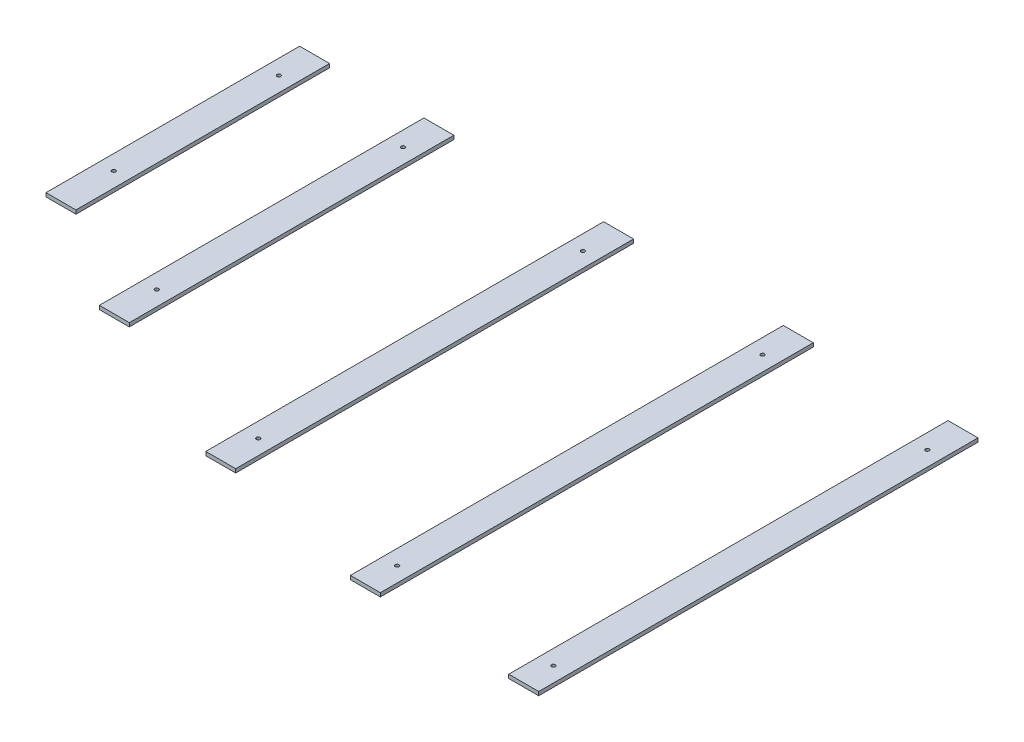
ISO-10303-21;
HEADER;
FILE_DESCRIPTION(('STEP AP214'),'2;1');
FILE_NAME('part.step','',(''),(''),'','','');
FILE_SCHEMA(('AUTOMOTIVE_DESIGN { 1 0 10303 214 1 1 1 1 }'));
ENDSEC;
DATA;
#1=APPLICATION_CONTEXT('core data for automotive mechanical design processes');
#2=APPLICATION_PROTOCOL_DEFINITION('international standard','automotive_design',2000,#1);
#3=PRODUCT_CONTEXT('',#1,'mechanical');
#4=PRODUCT('Part','Part','',(#3));
#5=PRODUCT_RELATED_PRODUCT_CATEGORY('part','',(#4));
#6=PRODUCT_DEFINITION_FORMATION('','',#4);
#7=PRODUCT_DEFINITION_CONTEXT('part definition',#1,'design');
#8=PRODUCT_DEFINITION('design','',#6,#7);
#9=PRODUCT_DEFINITION_SHAPE('','',#8);
#10=(LENGTH_UNIT() NAMED_UNIT(*) SI_UNIT(.MILLI.,.METRE.));
#11=(NAMED_UNIT(*) PLANE_ANGLE_UNIT() SI_UNIT($,.RADIAN.));
#12=(NAMED_UNIT(*) SI_UNIT($,.STERADIAN.) SOLID_ANGLE_UNIT());
#13=UNCERTAINTY_MEASURE_WITH_UNIT(LENGTH_MEASURE(1.E-05),#10,'distance_accuracy_value','');
#14=(GEOMETRIC_REPRESENTATION_CONTEXT(3) GLOBAL_UNCERTAINTY_ASSIGNED_CONTEXT((#13)) GLOBAL_UNIT_ASSIGNED_CONTEXT((#10,
#11,#12)) REPRESENTATION_CONTEXT('',''));
#15=CARTESIAN_POINT('',(0.,0.,0.));
#16=DIRECTION('',(0.,0.,1.));
#17=DIRECTION('',(1.,0.,0.));
#18=AXIS2_PLACEMENT_3D('',#15,#16,#17);
#19=CARTESIAN_POINT('',(0.,25.,0.));
#20=DIRECTION('',(0.,-1.,0.));
#21=DIRECTION('',(0.,0.,-1.));
#22=AXIS2_PLACEMENT_3D('',#19,#20,#21);
#23=PLANE('',#22);
#24=DIRECTION('',(0.,0.,-1.));
#25=VECTOR('',#24,1.);
#26=CARTESIAN_POINT('',(18902.9446458133,25.,9942.5828739722));
#27=LINE('',#26,#25);
#28=CARTESIAN_POINT('',(18902.9446458133,25.,11636.2194573529));
#29=VERTEX_POINT('',#28);
#30=CARTESIAN_POINT('',(18902.9446458133,25.,9942.5828739722));
#31=VERTEX_POINT('',#30);
#32=EDGE_CURVE('E96',#29,#31,#27,.T.);
#33=ORIENTED_EDGE('',*,*,#32,.T.);
#34=DIRECTION('',(-1.,0.,0.));
#35=VECTOR('',#34,1.);
#36=CARTESIAN_POINT('',(18902.9446458133,25.,9942.5828739722));
#37=LINE('',#36,#35);
#38=CARTESIAN_POINT('',(18702.9446458133,25.,9942.5828739722));
#39=VERTEX_POINT('',#38);
#40=EDGE_CURVE('E91',#31,#39,#37,.T.);
#41=ORIENTED_EDGE('',*,*,#40,.T.);
#42=DIRECTION('',(0.,0.,1.));
#43=VECTOR('',#42,1.);
#44=CARTESIAN_POINT('',(18702.9446458133,25.,9942.5828739722));
#45=LINE('',#44,#43);
#46=CARTESIAN_POINT('',(18702.9446458133,25.,11636.2194573529));
#47=VERTEX_POINT('',#46);
#48=EDGE_CURVE('E94',#39,#47,#45,.T.);
#49=ORIENTED_EDGE('',*,*,#48,.T.);
#50=DIRECTION('',(1.,0.,0.));
#51=VECTOR('',#50,1.);
#52=CARTESIAN_POINT('',(18902.9446458133,25.,11636.2194573529));
#53=LINE('',#52,#51);
#54=EDGE_CURVE('E61',#47,#29,#53,.T.);
#55=ORIENTED_EDGE('',*,*,#54,.T.);
#56=EDGE_LOOP('',(#33,#41,#49,#55));
#57=FACE_BOUND('',#56,.T.);
#58=CARTESIAN_POINT('',(18802.9446458133,25.,11283.6697787735));
#59=DIRECTION('',(0.,1.,0.));
#60=DIRECTION('',(0.,0.,1.));
#61=AXIS2_PLACEMENT_3D('',#58,#59,#60);
#62=CIRCLE('',#61,12.4999999999988);
#63=CARTESIAN_POINT('',(18802.9446458133,25.,11296.1697787735));
#64=VERTEX_POINT('',#63);
#65=EDGE_CURVE('E111',#64,#64,#62,.T.);
#66=ORIENTED_EDGE('',*,*,#65,.F.);
#67=EDGE_LOOP('',(#66));
#68=FACE_BOUND('',#67,.T.);
#69=CARTESIAN_POINT('',(18802.9446458133,25.,10181.0304593336));
#70=DIRECTION('',(0.,1.,0.));
#71=DIRECTION('',(0.,0.,1.));
#72=AXIS2_PLACEMENT_3D('',#69,#70,#71);
#73=CIRCLE('',#72,12.4999999999988);
#74=CARTESIAN_POINT('',(18802.9446458133,25.,10193.5304593336));
#75=VERTEX_POINT('',#74);
#76=EDGE_CURVE('E126',#75,#75,#73,.T.);
#77=ORIENTED_EDGE('',*,*,#76,.F.);
#78=EDGE_LOOP('',(#77));
#79=FACE_BOUND('',#78,.T.);
#80=ADVANCED_FACE('F44',(#57,#68,#79),#23,.F.);
#81=CARTESIAN_POINT('',(0.,0.,0.));
#82=DIRECTION('',(0.,-1.,0.));
#83=DIRECTION('',(0.,0.,-1.));
#84=AXIS2_PLACEMENT_3D('',#81,#82,#83);
#85=PLANE('',#84);
#86=CARTESIAN_POINT('',(18802.9446458133,0.,11283.6697787735));
#87=DIRECTION('',(0.,1.,0.));
#88=DIRECTION('',(0.,0.,1.));
#89=AXIS2_PLACEMENT_3D('',#86,#87,#88);
#90=CIRCLE('',#89,12.4999999999988);
#91=CARTESIAN_POINT('',(18802.9446458133,0.,11296.1697787735));
#92=VERTEX_POINT('',#91);
#93=EDGE_CURVE('E123',#92,#92,#90,.T.);
#94=ORIENTED_EDGE('',*,*,#93,.T.);
#95=EDGE_LOOP('',(#94));
#96=FACE_BOUND('',#95,.T.);
#97=DIRECTION('',(0.,0.,-1.));
#98=VECTOR('',#97,1.);
#99=CARTESIAN_POINT('',(18902.9446458133,0.,9942.5828739722));
#100=LINE('',#99,#98);
#101=CARTESIAN_POINT('',(18902.9446458133,0.,11636.2194573529));
#102=VERTEX_POINT('',#101);
#103=CARTESIAN_POINT('',(18902.9446458133,0.,9942.5828739722));
#104=VERTEX_POINT('',#103);
#105=EDGE_CURVE('E108',#102,#104,#100,.T.);
#106=ORIENTED_EDGE('',*,*,#105,.F.);
#107=DIRECTION('',(1.,0.,0.));
#108=VECTOR('',#107,1.);
#109=CARTESIAN_POINT('',(18902.9446458133,0.,11636.2194573529));
#110=LINE('',#109,#108);
#111=CARTESIAN_POINT('',(18702.9446458133,0.,11636.2194573529));
#112=VERTEX_POINT('',#111);
#113=EDGE_CURVE('E84',#112,#102,#110,.T.);
#114=ORIENTED_EDGE('',*,*,#113,.F.);
#115=DIRECTION('',(0.,0.,1.));
#116=VECTOR('',#115,1.);
#117=CARTESIAN_POINT('',(18702.9446458133,0.,9942.5828739722));
#118=LINE('',#117,#116);
#119=CARTESIAN_POINT('',(18702.9446458133,0.,9942.5828739722));
#120=VERTEX_POINT('',#119);
#121=EDGE_CURVE('E78',#120,#112,#118,.T.);
#122=ORIENTED_EDGE('',*,*,#121,.F.);
#123=DIRECTION('',(-1.,0.,0.));
#124=VECTOR('',#123,1.);
#125=CARTESIAN_POINT('',(18902.9446458133,0.,9942.5828739722));
#126=LINE('',#125,#124);
#127=EDGE_CURVE('E100',#104,#120,#126,.T.);
#128=ORIENTED_EDGE('',*,*,#127,.F.);
#129=EDGE_LOOP('',(#106,#114,#122,#128));
#130=FACE_BOUND('',#129,.T.);
#131=CARTESIAN_POINT('',(18802.9446458133,0.,10181.0304593336));
#132=DIRECTION('',(0.,1.,0.));
#133=DIRECTION('',(0.,0.,1.));
#134=AXIS2_PLACEMENT_3D('',#131,#132,#133);
#135=CIRCLE('',#134,12.4999999999988);
#136=CARTESIAN_POINT('',(18802.9446458133,0.,10193.5304593336));
#137=VERTEX_POINT('',#136);
#138=EDGE_CURVE('E129',#137,#137,#135,.T.);
#139=ORIENTED_EDGE('',*,*,#138,.T.);
#140=EDGE_LOOP('',(#139));
#141=FACE_BOUND('',#140,.T.);
#142=ADVANCED_FACE('F119',(#96,#130,#141),#85,.T.);
#143=CARTESIAN_POINT('',(18902.9446458133,25.,9942.5828739722));
#144=DIRECTION('',(-1.,0.,0.));
#145=DIRECTION('',(0.,0.,1.));
#146=AXIS2_PLACEMENT_3D('',#143,#144,#145);
#147=PLANE('',#146);
#148=ORIENTED_EDGE('',*,*,#105,.T.);
#149=DIRECTION('',(0.,-1.,0.));
#150=VECTOR('',#149,1.);
#151=CARTESIAN_POINT('',(18902.9446458133,25.,9942.5828739722));
#152=LINE('',#151,#150);
#153=EDGE_CURVE('E12',#31,#104,#152,.T.);
#154=ORIENTED_EDGE('',*,*,#153,.F.);
#155=ORIENTED_EDGE('',*,*,#32,.F.);
#156=DIRECTION('',(0.,-1.,0.));
#157=VECTOR('',#156,1.);
#158=CARTESIAN_POINT('',(18902.9446458133,25.,11636.2194573529));
#159=LINE('',#158,#157);
#160=EDGE_CURVE('E104',#29,#102,#159,.T.);
#161=ORIENTED_EDGE('',*,*,#160,.T.);
#162=EDGE_LOOP('',(#148,#154,#155,#161));
#163=FACE_BOUND('',#162,.T.);
#164=ADVANCED_FACE('F46',(#163),#147,.F.);
#165=CARTESIAN_POINT('',(18902.9446458133,25.,9942.5828739722));
#166=DIRECTION('',(0.,0.,1.));
#167=DIRECTION('',(1.,0.,0.));
#168=AXIS2_PLACEMENT_3D('',#165,#166,#167);
#169=PLANE('',#168);
#170=ORIENTED_EDGE('',*,*,#127,.T.);
#171=DIRECTION('',(0.,-1.,0.));
#172=VECTOR('',#171,1.);
#173=CARTESIAN_POINT('',(18702.9446458133,25.,9942.5828739722));
#174=LINE('',#173,#172);
#175=EDGE_CURVE('E53',#39,#120,#174,.T.);
#176=ORIENTED_EDGE('',*,*,#175,.F.);
#177=ORIENTED_EDGE('',*,*,#40,.F.);
#178=ORIENTED_EDGE('',*,*,#153,.T.);
#179=EDGE_LOOP('',(#170,#176,#177,#178));
#180=FACE_BOUND('',#179,.T.);
#181=ADVANCED_FACE('F99',(#180),#169,.F.);
#182=CARTESIAN_POINT('',(18702.9446458133,25.,9942.5828739722));
#183=DIRECTION('',(1.,0.,0.));
#184=DIRECTION('',(0.,0.,-1.));
#185=AXIS2_PLACEMENT_3D('',#182,#183,#184);
#186=PLANE('',#185);
#187=ORIENTED_EDGE('',*,*,#121,.T.);
#188=DIRECTION('',(0.,-1.,0.));
#189=VECTOR('',#188,1.);
#190=CARTESIAN_POINT('',(18702.9446458133,25.,11636.2194573529));
#191=LINE('',#190,#189);
#192=EDGE_CURVE('E101',#47,#112,#191,.T.);
#193=ORIENTED_EDGE('',*,*,#192,.F.);
#194=ORIENTED_EDGE('',*,*,#48,.F.);
#195=ORIENTED_EDGE('',*,*,#175,.T.);
#196=EDGE_LOOP('',(#187,#193,#194,#195));
#197=FACE_BOUND('',#196,.T.);
#198=ADVANCED_FACE('F102',(#197),#186,.F.);
#199=CARTESIAN_POINT('',(18902.9446458133,25.,11636.2194573529));
#200=DIRECTION('',(0.,0.,-1.));
#201=DIRECTION('',(-1.,0.,0.));
#202=AXIS2_PLACEMENT_3D('',#199,#200,#201);
#203=PLANE('',#202);
#204=ORIENTED_EDGE('',*,*,#113,.T.);
#205=ORIENTED_EDGE('',*,*,#160,.F.);
#206=ORIENTED_EDGE('',*,*,#54,.F.);
#207=ORIENTED_EDGE('',*,*,#192,.T.);
#208=EDGE_LOOP('',(#204,#205,#206,#207));
#209=FACE_BOUND('',#208,.T.);
#210=ADVANCED_FACE('F116',(#209),#203,.F.);
#211=CARTESIAN_POINT('',(18802.9446458133,25.,11283.6697787735));
#212=DIRECTION('',(0.,-1.,0.));
#213=DIRECTION('',(0.,0.,-1.));
#214=AXIS2_PLACEMENT_3D('',#211,#212,#213);
#215=CYLINDRICAL_SURFACE('',#214,12.4999999999988);
#216=ORIENTED_EDGE('',*,*,#65,.T.);
#217=EDGE_LOOP('',(#216));
#218=FACE_BOUND('',#217,.T.);
#219=ORIENTED_EDGE('',*,*,#93,.F.);
#220=EDGE_LOOP('',(#219));
#221=FACE_BOUND('',#220,.T.);
#222=ADVANCED_FACE('F146',(#218,#221),#215,.F.);
#223=CARTESIAN_POINT('',(18802.9446458133,25.,10181.0304593336));
#224=DIRECTION('',(0.,-1.,0.));
#225=DIRECTION('',(0.,0.,-1.));
#226=AXIS2_PLACEMENT_3D('',#223,#224,#225);
#227=CYLINDRICAL_SURFACE('',#226,12.4999999999988);
#228=ORIENTED_EDGE('',*,*,#76,.T.);
#229=EDGE_LOOP('',(#228));
#230=FACE_BOUND('',#229,.T.);
#231=ORIENTED_EDGE('',*,*,#138,.F.);
#232=EDGE_LOOP('',(#231));
#233=FACE_BOUND('',#232,.T.);
#234=ADVANCED_FACE('F135',(#230,#233),#227,.F.);
#235=CLOSED_SHELL('',(#80,#142,#164,#181,#198,#210,#222,#234));
#236=MANIFOLD_SOLID_BREP('B2',#235);
#237=CARTESIAN_POINT('',(0.,25.,0.));
#238=DIRECTION('',(0.,-1.,0.));
#239=DIRECTION('',(0.,0.,-1.));
#240=AXIS2_PLACEMENT_3D('',#237,#238,#239);
#241=PLANE('',#240);
#242=DIRECTION('',(0.,0.,-1.));
#243=VECTOR('',#242,1.);
#244=CARTESIAN_POINT('',(19732.9446458133,25.,9942.5828739722));
#245=LINE('',#244,#243);
#246=CARTESIAN_POINT('',(19732.9446458133,25.,12109.8435727021));
#247=VERTEX_POINT('',#246);
#248=CARTESIAN_POINT('',(19732.9446458133,25.,9942.5828739722));
#249=VERTEX_POINT('',#248);
#250=EDGE_CURVE('E272',#247,#249,#245,.T.);
#251=ORIENTED_EDGE('',*,*,#250,.T.);
#252=DIRECTION('',(-1.,0.,0.));
#253=VECTOR('',#252,1.);
#254=CARTESIAN_POINT('',(19732.9446458133,25.,9942.5828739722));
#255=LINE('',#254,#253);
#256=CARTESIAN_POINT('',(19532.9446458133,25.,9942.5828739722));
#257=VERTEX_POINT('',#256);
#258=EDGE_CURVE('E267',#249,#257,#255,.T.);
#259=ORIENTED_EDGE('',*,*,#258,.T.);
#260=DIRECTION('',(0.,0.,1.));
#261=VECTOR('',#260,1.);
#262=CARTESIAN_POINT('',(19532.9446458133,25.,9942.5828739722));
#263=LINE('',#262,#261);
#264=CARTESIAN_POINT('',(19532.9446458133,25.,12109.8435727021));
#265=VERTEX_POINT('',#264);
#266=EDGE_CURVE('E270',#257,#265,#263,.T.);
#267=ORIENTED_EDGE('',*,*,#266,.T.);
#268=DIRECTION('',(1.,0.,0.));
#269=VECTOR('',#268,1.);
#270=CARTESIAN_POINT('',(19732.9446458133,25.,12109.8435727021));
#271=LINE('',#270,#269);
#272=EDGE_CURVE('E237',#265,#247,#271,.T.);
#273=ORIENTED_EDGE('',*,*,#272,.T.);
#274=EDGE_LOOP('',(#251,#259,#267,#273));
#275=FACE_BOUND('',#274,.T.);
#276=CARTESIAN_POINT('',(19632.9446458133,25.,11826.9154481533));
#277=DIRECTION('',(0.,1.,0.));
#278=DIRECTION('',(0.,0.,1.));
#279=AXIS2_PLACEMENT_3D('',#276,#277,#278);
#280=CIRCLE('',#279,12.4999999999988);
#281=CARTESIAN_POINT('',(19632.9446458133,25.,11839.4154481533));
#282=VERTEX_POINT('',#281);
#283=EDGE_CURVE('E287',#282,#282,#280,.T.);
#284=ORIENTED_EDGE('',*,*,#283,.F.);
#285=EDGE_LOOP('',(#284));
#286=FACE_BOUND('',#285,.T.);
#287=CARTESIAN_POINT('',(19632.9446458133,25.,10181.0304593336));
#288=DIRECTION('',(0.,1.,0.));
#289=DIRECTION('',(0.,0.,1.));
#290=AXIS2_PLACEMENT_3D('',#287,#288,#289);
#291=CIRCLE('',#290,12.4999999999988);
#292=CARTESIAN_POINT('',(19632.9446458133,25.,10193.5304593336));
#293=VERTEX_POINT('',#292);
#294=EDGE_CURVE('E302',#293,#293,#291,.T.);
#295=ORIENTED_EDGE('',*,*,#294,.F.);
#296=EDGE_LOOP('',(#295));
#297=FACE_BOUND('',#296,.T.);
#298=ADVANCED_FACE('F220',(#275,#286,#297),#241,.F.);
#299=CARTESIAN_POINT('',(0.,0.,0.));
#300=DIRECTION('',(0.,-1.,0.));
#301=DIRECTION('',(0.,0.,-1.));
#302=AXIS2_PLACEMENT_3D('',#299,#300,#301);
#303=PLANE('',#302);
#304=CARTESIAN_POINT('',(19632.9446458133,0.,11826.9154481533));
#305=DIRECTION('',(0.,1.,0.));
#306=DIRECTION('',(0.,0.,1.));
#307=AXIS2_PLACEMENT_3D('',#304,#305,#306);
#308=CIRCLE('',#307,12.4999999999988);
#309=CARTESIAN_POINT('',(19632.9446458133,0.,11839.4154481533));
#310=VERTEX_POINT('',#309);
#311=EDGE_CURVE('E299',#310,#310,#308,.T.);
#312=ORIENTED_EDGE('',*,*,#311,.T.);
#313=EDGE_LOOP('',(#312));
#314=FACE_BOUND('',#313,.T.);
#315=DIRECTION('',(0.,0.,-1.));
#316=VECTOR('',#315,1.);
#317=CARTESIAN_POINT('',(19732.9446458133,0.,9942.5828739722));
#318=LINE('',#317,#316);
#319=CARTESIAN_POINT('',(19732.9446458133,0.,12109.8435727021));
#320=VERTEX_POINT('',#319);
#321=CARTESIAN_POINT('',(19732.9446458133,0.,9942.5828739722));
#322=VERTEX_POINT('',#321);
#323=EDGE_CURVE('E284',#320,#322,#318,.T.);
#324=ORIENTED_EDGE('',*,*,#323,.F.);
#325=DIRECTION('',(1.,0.,0.));
#326=VECTOR('',#325,1.);
#327=CARTESIAN_POINT('',(19732.9446458133,0.,12109.8435727021));
#328=LINE('',#327,#326);
#329=CARTESIAN_POINT('',(19532.9446458133,0.,12109.8435727021));
#330=VERTEX_POINT('',#329);
#331=EDGE_CURVE('E260',#330,#320,#328,.T.);
#332=ORIENTED_EDGE('',*,*,#331,.F.);
#333=DIRECTION('',(0.,0.,1.));
#334=VECTOR('',#333,1.);
#335=CARTESIAN_POINT('',(19532.9446458133,0.,9942.5828739722));
#336=LINE('',#335,#334);
#337=CARTESIAN_POINT('',(19532.9446458133,0.,9942.5828739722));
#338=VERTEX_POINT('',#337);
#339=EDGE_CURVE('E254',#338,#330,#336,.T.);
#340=ORIENTED_EDGE('',*,*,#339,.F.);
#341=DIRECTION('',(-1.,0.,0.));
#342=VECTOR('',#341,1.);
#343=CARTESIAN_POINT('',(19732.9446458133,0.,9942.5828739722));
#344=LINE('',#343,#342);
#345=EDGE_CURVE('E276',#322,#338,#344,.T.);
#346=ORIENTED_EDGE('',*,*,#345,.F.);
#347=EDGE_LOOP('',(#324,#332,#340,#346));
#348=FACE_BOUND('',#347,.T.);
#349=CARTESIAN_POINT('',(19632.9446458133,0.,10181.0304593336));
#350=DIRECTION('',(0.,1.,0.));
#351=DIRECTION('',(0.,0.,1.));
#352=AXIS2_PLACEMENT_3D('',#349,#350,#351);
#353=CIRCLE('',#352,12.4999999999988);
#354=CARTESIAN_POINT('',(19632.9446458133,0.,10193.5304593336));
#355=VERTEX_POINT('',#354);
#356=EDGE_CURVE('E305',#355,#355,#353,.T.);
#357=ORIENTED_EDGE('',*,*,#356,.T.);
#358=EDGE_LOOP('',(#357));
#359=FACE_BOUND('',#358,.T.);
#360=ADVANCED_FACE('F295',(#314,#348,#359),#303,.T.);
#361=CARTESIAN_POINT('',(19732.9446458133,25.,9942.5828739722));
#362=DIRECTION('',(-1.,0.,0.));
#363=DIRECTION('',(0.,0.,1.));
#364=AXIS2_PLACEMENT_3D('',#361,#362,#363);
#365=PLANE('',#364);
#366=ORIENTED_EDGE('',*,*,#323,.T.);
#367=DIRECTION('',(0.,-1.,0.));
#368=VECTOR('',#367,1.);
#369=CARTESIAN_POINT('',(19732.9446458133,25.,9942.5828739722));
#370=LINE('',#369,#368);
#371=EDGE_CURVE('E42',#249,#322,#370,.T.);
#372=ORIENTED_EDGE('',*,*,#371,.F.);
#373=ORIENTED_EDGE('',*,*,#250,.F.);
#374=DIRECTION('',(0.,-1.,0.));
#375=VECTOR('',#374,1.);
#376=CARTESIAN_POINT('',(19732.9446458133,25.,12109.8435727021));
#377=LINE('',#376,#375);
#378=EDGE_CURVE('E280',#247,#320,#377,.T.);
#379=ORIENTED_EDGE('',*,*,#378,.T.);
#380=EDGE_LOOP('',(#366,#372,#373,#379));
#381=FACE_BOUND('',#380,.T.);
#382=ADVANCED_FACE('F222',(#381),#365,.F.);
#383=CARTESIAN_POINT('',(19732.9446458133,25.,9942.5828739722));
#384=DIRECTION('',(0.,0.,1.));
#385=DIRECTION('',(1.,0.,0.));
#386=AXIS2_PLACEMENT_3D('',#383,#384,#385);
#387=PLANE('',#386);
#388=ORIENTED_EDGE('',*,*,#345,.T.);
#389=DIRECTION('',(0.,-1.,0.));
#390=VECTOR('',#389,1.);
#391=CARTESIAN_POINT('',(19532.9446458133,25.,9942.5828739722));
#392=LINE('',#391,#390);
#393=EDGE_CURVE('E229',#257,#338,#392,.T.);
#394=ORIENTED_EDGE('',*,*,#393,.F.);
#395=ORIENTED_EDGE('',*,*,#258,.F.);
#396=ORIENTED_EDGE('',*,*,#371,.T.);
#397=EDGE_LOOP('',(#388,#394,#395,#396));
#398=FACE_BOUND('',#397,.T.);
#399=ADVANCED_FACE('F275',(#398),#387,.F.);
#400=CARTESIAN_POINT('',(19532.9446458133,25.,9942.5828739722));
#401=DIRECTION('',(1.,0.,0.));
#402=DIRECTION('',(0.,0.,-1.));
#403=AXIS2_PLACEMENT_3D('',#400,#401,#402);
#404=PLANE('',#403);
#405=ORIENTED_EDGE('',*,*,#339,.T.);
#406=DIRECTION('',(0.,-1.,0.));
#407=VECTOR('',#406,1.);
#408=CARTESIAN_POINT('',(19532.9446458133,25.,12109.8435727021));
#409=LINE('',#408,#407);
#410=EDGE_CURVE('E277',#265,#330,#409,.T.);
#411=ORIENTED_EDGE('',*,*,#410,.F.);
#412=ORIENTED_EDGE('',*,*,#266,.F.);
#413=ORIENTED_EDGE('',*,*,#393,.T.);
#414=EDGE_LOOP('',(#405,#411,#412,#413));
#415=FACE_BOUND('',#414,.T.);
#416=ADVANCED_FACE('F278',(#415),#404,.F.);
#417=CARTESIAN_POINT('',(19732.9446458133,25.,12109.8435727021));
#418=DIRECTION('',(0.,0.,-1.));
#419=DIRECTION('',(-1.,0.,0.));
#420=AXIS2_PLACEMENT_3D('',#417,#418,#419);
#421=PLANE('',#420);
#422=ORIENTED_EDGE('',*,*,#331,.T.);
#423=ORIENTED_EDGE('',*,*,#378,.F.);
#424=ORIENTED_EDGE('',*,*,#272,.F.);
#425=ORIENTED_EDGE('',*,*,#410,.T.);
#426=EDGE_LOOP('',(#422,#423,#424,#425));
#427=FACE_BOUND('',#426,.T.);
#428=ADVANCED_FACE('F292',(#427),#421,.F.);
#429=CARTESIAN_POINT('',(19632.9446458133,25.,11826.9154481533));
#430=DIRECTION('',(0.,-1.,0.));
#431=DIRECTION('',(0.,0.,-1.));
#432=AXIS2_PLACEMENT_3D('',#429,#430,#431);
#433=CYLINDRICAL_SURFACE('',#432,12.4999999999988);
#434=ORIENTED_EDGE('',*,*,#283,.T.);
#435=EDGE_LOOP('',(#434));
#436=FACE_BOUND('',#435,.T.);
#437=ORIENTED_EDGE('',*,*,#311,.F.);
#438=EDGE_LOOP('',(#437));
#439=FACE_BOUND('',#438,.T.);
#440=ADVANCED_FACE('F322',(#436,#439),#433,.F.);
#441=CARTESIAN_POINT('',(19632.9446458133,25.,10181.0304593336));
#442=DIRECTION('',(0.,-1.,0.));
#443=DIRECTION('',(0.,0.,-1.));
#444=AXIS2_PLACEMENT_3D('',#441,#442,#443);
#445=CYLINDRICAL_SURFACE('',#444,12.4999999999988);
#446=ORIENTED_EDGE('',*,*,#294,.T.);
#447=EDGE_LOOP('',(#446));
#448=FACE_BOUND('',#447,.T.);
#449=ORIENTED_EDGE('',*,*,#356,.F.);
#450=EDGE_LOOP('',(#449));
#451=FACE_BOUND('',#450,.T.);
#452=ADVANCED_FACE('F311',(#448,#451),#445,.F.);
#453=CLOSED_SHELL('',(#298,#360,#382,#399,#416,#428,#440,#452));
#454=MANIFOLD_SOLID_BREP('B6',#453);
#455=CARTESIAN_POINT('',(0.,25.,0.));
#456=DIRECTION('',(0.,-1.,0.));
#457=DIRECTION('',(0.,0.,-1.));
#458=AXIS2_PLACEMENT_3D('',#455,#456,#457);
#459=PLANE('',#458);
#460=DIRECTION('',(0.,0.,-1.));
#461=VECTOR('',#460,1.);
#462=CARTESIAN_POINT('',(20932.9446458133,25.,9942.5828739722));
#463=LINE('',#462,#461);
#464=CARTESIAN_POINT('',(20932.9446458133,25.,12599.4325458721));
#465=VERTEX_POINT('',#464);
#466=CARTESIAN_POINT('',(20932.9446458133,25.,9942.5828739722));
#467=VERTEX_POINT('',#466);
#468=EDGE_CURVE('E448',#465,#467,#463,.T.);
#469=ORIENTED_EDGE('',*,*,#468,.T.);
#470=DIRECTION('',(-1.,0.,0.));
#471=VECTOR('',#470,1.);
#472=CARTESIAN_POINT('',(20932.9446458133,25.,9942.5828739722));
#473=LINE('',#472,#471);
#474=CARTESIAN_POINT('',(20732.9446458133,25.,9942.5828739722));
#475=VERTEX_POINT('',#474);
#476=EDGE_CURVE('E443',#467,#475,#473,.T.);
#477=ORIENTED_EDGE('',*,*,#476,.T.);
#478=DIRECTION('',(0.,0.,1.));
#479=VECTOR('',#478,1.);
#480=CARTESIAN_POINT('',(20732.9446458133,25.,9942.5828739722));
#481=LINE('',#480,#479);
#482=CARTESIAN_POINT('',(20732.9446458133,25.,12599.4325458721));
#483=VERTEX_POINT('',#482);
#484=EDGE_CURVE('E446',#475,#483,#481,.T.);
#485=ORIENTED_EDGE('',*,*,#484,.T.);
#486=DIRECTION('',(1.,0.,0.));
#487=VECTOR('',#486,1.);
#488=CARTESIAN_POINT('',(20932.9446458133,25.,12599.4325458721));
#489=LINE('',#488,#487);
#490=EDGE_CURVE('E413',#483,#465,#489,.T.);
#491=ORIENTED_EDGE('',*,*,#490,.T.);
#492=EDGE_LOOP('',(#469,#477,#485,#491));
#493=FACE_BOUND('',#492,.T.);
#494=CARTESIAN_POINT('',(20832.9446458133,25.,12348.754240871));
#495=DIRECTION('',(0.,1.,0.));
#496=DIRECTION('',(0.,0.,1.));
#497=AXIS2_PLACEMENT_3D('',#494,#495,#496);
#498=CIRCLE('',#497,12.4999999999988);
#499=CARTESIAN_POINT('',(20832.9446458133,25.,12361.254240871));
#500=VERTEX_POINT('',#499);
#501=EDGE_CURVE('E463',#500,#500,#498,.T.);
#502=ORIENTED_EDGE('',*,*,#501,.F.);
#503=EDGE_LOOP('',(#502));
#504=FACE_BOUND('',#503,.T.);
#505=CARTESIAN_POINT('',(20832.9446458133,25.,10181.0304593336));
#506=DIRECTION('',(0.,1.,0.));
#507=DIRECTION('',(0.,0.,1.));
#508=AXIS2_PLACEMENT_3D('',#505,#506,#507);
#509=CIRCLE('',#508,12.4999999999988);
#510=CARTESIAN_POINT('',(20832.9446458133,25.,10193.5304593336));
#511=VERTEX_POINT('',#510);
#512=EDGE_CURVE('E478',#511,#511,#509,.T.);
#513=ORIENTED_EDGE('',*,*,#512,.F.);
#514=EDGE_LOOP('',(#513));
#515=FACE_BOUND('',#514,.T.);
#516=ADVANCED_FACE('F396',(#493,#504,#515),#459,.F.);
#517=CARTESIAN_POINT('',(0.,0.,0.));
#518=DIRECTION('',(0.,-1.,0.));
#519=DIRECTION('',(0.,0.,-1.));
#520=AXIS2_PLACEMENT_3D('',#517,#518,#519);
#521=PLANE('',#520);
#522=CARTESIAN_POINT('',(20832.9446458133,0.,12348.754240871));
#523=DIRECTION('',(0.,1.,0.));
#524=DIRECTION('',(0.,0.,1.));
#525=AXIS2_PLACEMENT_3D('',#522,#523,#524);
#526=CIRCLE('',#525,12.4999999999988);
#527=CARTESIAN_POINT('',(20832.9446458133,0.,12361.254240871));
#528=VERTEX_POINT('',#527);
#529=EDGE_CURVE('E475',#528,#528,#526,.T.);
#530=ORIENTED_EDGE('',*,*,#529,.T.);
#531=EDGE_LOOP('',(#530));
#532=FACE_BOUND('',#531,.T.);
#533=DIRECTION('',(0.,0.,-1.));
#534=VECTOR('',#533,1.);
#535=CARTESIAN_POINT('',(20932.9446458133,0.,9942.5828739722));
#536=LINE('',#535,#534);
#537=CARTESIAN_POINT('',(20932.9446458133,0.,12599.4325458721));
#538=VERTEX_POINT('',#537);
#539=CARTESIAN_POINT('',(20932.9446458133,0.,9942.5828739722));
#540=VERTEX_POINT('',#539);
#541=EDGE_CURVE('E460',#538,#540,#536,.T.);
#542=ORIENTED_EDGE('',*,*,#541,.F.);
#543=DIRECTION('',(1.,0.,0.));
#544=VECTOR('',#543,1.);
#545=CARTESIAN_POINT('',(20932.9446458133,0.,12599.4325458721));
#546=LINE('',#545,#544);
#547=CARTESIAN_POINT('',(20732.9446458133,0.,12599.4325458721));
#548=VERTEX_POINT('',#547);
#549=EDGE_CURVE('E436',#548,#538,#546,.T.);
#550=ORIENTED_EDGE('',*,*,#549,.F.);
#551=DIRECTION('',(0.,0.,1.));
#552=VECTOR('',#551,1.);
#553=CARTESIAN_POINT('',(20732.9446458133,0.,9942.5828739722));
#554=LINE('',#553,#552);
#555=CARTESIAN_POINT('',(20732.9446458133,0.,9942.5828739722));
#556=VERTEX_POINT('',#555);
#557=EDGE_CURVE('E430',#556,#548,#554,.T.);
#558=ORIENTED_EDGE('',*,*,#557,.F.);
#559=DIRECTION('',(-1.,0.,0.));
#560=VECTOR('',#559,1.);
#561=CARTESIAN_POINT('',(20932.9446458133,0.,9942.5828739722));
#562=LINE('',#561,#560);
#563=EDGE_CURVE('E452',#540,#556,#562,.T.);
#564=ORIENTED_EDGE('',*,*,#563,.F.);
#565=EDGE_LOOP('',(#542,#550,#558,#564));
#566=FACE_BOUND('',#565,.T.);
#567=CARTESIAN_POINT('',(20832.9446458133,0.,10181.0304593336));
#568=DIRECTION('',(0.,1.,0.));
#569=DIRECTION('',(0.,0.,1.));
#570=AXIS2_PLACEMENT_3D('',#567,#568,#569);
#571=CIRCLE('',#570,12.4999999999988);
#572=CARTESIAN_POINT('',(20832.9446458133,0.,10193.5304593336));
#573=VERTEX_POINT('',#572);
#574=EDGE_CURVE('E481',#573,#573,#571,.T.);
#575=ORIENTED_EDGE('',*,*,#574,.T.);
#576=EDGE_LOOP('',(#575));
#577=FACE_BOUND('',#576,.T.);
#578=ADVANCED_FACE('F471',(#532,#566,#577),#521,.T.);
#579=CARTESIAN_POINT('',(20932.9446458133,25.,9942.5828739722));
#580=DIRECTION('',(-1.,0.,0.));
#581=DIRECTION('',(0.,0.,1.));
#582=AXIS2_PLACEMENT_3D('',#579,#580,#581);
#583=PLANE('',#582);
#584=ORIENTED_EDGE('',*,*,#541,.T.);
#585=DIRECTION('',(0.,-1.,0.));
#586=VECTOR('',#585,1.);
#587=CARTESIAN_POINT('',(20932.9446458133,25.,9942.5828739722));
#588=LINE('',#587,#586);
#589=EDGE_CURVE('E218',#467,#540,#588,.T.);
#590=ORIENTED_EDGE('',*,*,#589,.F.);
#591=ORIENTED_EDGE('',*,*,#468,.F.);
#592=DIRECTION('',(0.,-1.,0.));
#593=VECTOR('',#592,1.);
#594=CARTESIAN_POINT('',(20932.9446458133,25.,12599.4325458721));
#595=LINE('',#594,#593);
#596=EDGE_CURVE('E456',#465,#538,#595,.T.);
#597=ORIENTED_EDGE('',*,*,#596,.T.);
#598=EDGE_LOOP('',(#584,#590,#591,#597));
#599=FACE_BOUND('',#598,.T.);
#600=ADVANCED_FACE('F398',(#599),#583,.F.);
#601=CARTESIAN_POINT('',(20932.9446458133,25.,9942.5828739722));
#602=DIRECTION('',(0.,0.,1.));
#603=DIRECTION('',(1.,0.,0.));
#604=AXIS2_PLACEMENT_3D('',#601,#602,#603);
#605=PLANE('',#604);
#606=ORIENTED_EDGE('',*,*,#563,.T.);
#607=DIRECTION('',(0.,-1.,0.));
#608=VECTOR('',#607,1.);
#609=CARTESIAN_POINT('',(20732.9446458133,25.,9942.5828739722));
#610=LINE('',#609,#608);
#611=EDGE_CURVE('E405',#475,#556,#610,.T.);
#612=ORIENTED_EDGE('',*,*,#611,.F.);
#613=ORIENTED_EDGE('',*,*,#476,.F.);
#614=ORIENTED_EDGE('',*,*,#589,.T.);
#615=EDGE_LOOP('',(#606,#612,#613,#614));
#616=FACE_BOUND('',#615,.T.);
#617=ADVANCED_FACE('F451',(#616),#605,.F.);
#618=CARTESIAN_POINT('',(20732.9446458133,25.,9942.5828739722));
#619=DIRECTION('',(1.,0.,0.));
#620=DIRECTION('',(0.,0.,-1.));
#621=AXIS2_PLACEMENT_3D('',#618,#619,#620);
#622=PLANE('',#621);
#623=ORIENTED_EDGE('',*,*,#557,.T.);
#624=DIRECTION('',(0.,-1.,0.));
#625=VECTOR('',#624,1.);
#626=CARTESIAN_POINT('',(20732.9446458133,25.,12599.4325458721));
#627=LINE('',#626,#625);
#628=EDGE_CURVE('E453',#483,#548,#627,.T.);
#629=ORIENTED_EDGE('',*,*,#628,.F.);
#630=ORIENTED_EDGE('',*,*,#484,.F.);
#631=ORIENTED_EDGE('',*,*,#611,.T.);
#632=EDGE_LOOP('',(#623,#629,#630,#631));
#633=FACE_BOUND('',#632,.T.);
#634=ADVANCED_FACE('F454',(#633),#622,.F.);
#635=CARTESIAN_POINT('',(20932.9446458133,25.,12599.4325458721));
#636=DIRECTION('',(0.,0.,-1.));
#637=DIRECTION('',(-1.,0.,0.));
#638=AXIS2_PLACEMENT_3D('',#635,#636,#637);
#639=PLANE('',#638);
#640=ORIENTED_EDGE('',*,*,#549,.T.);
#641=ORIENTED_EDGE('',*,*,#596,.F.);
#642=ORIENTED_EDGE('',*,*,#490,.F.);
#643=ORIENTED_EDGE('',*,*,#628,.T.);
#644=EDGE_LOOP('',(#640,#641,#642,#643));
#645=FACE_BOUND('',#644,.T.);
#646=ADVANCED_FACE('F468',(#645),#639,.F.);
#647=CARTESIAN_POINT('',(20832.9446458133,25.,12348.754240871));
#648=DIRECTION('',(0.,-1.,0.));
#649=DIRECTION('',(0.,0.,-1.));
#650=AXIS2_PLACEMENT_3D('',#647,#648,#649);
#651=CYLINDRICAL_SURFACE('',#650,12.4999999999988);
#652=ORIENTED_EDGE('',*,*,#501,.T.);
#653=EDGE_LOOP('',(#652));
#654=FACE_BOUND('',#653,.T.);
#655=ORIENTED_EDGE('',*,*,#529,.F.);
#656=EDGE_LOOP('',(#655));
#657=FACE_BOUND('',#656,.T.);
#658=ADVANCED_FACE('F498',(#654,#657),#651,.F.);
#659=CARTESIAN_POINT('',(20832.9446458133,25.,10181.0304593336));
#660=DIRECTION('',(0.,-1.,0.));
#661=DIRECTION('',(0.,0.,-1.));
#662=AXIS2_PLACEMENT_3D('',#659,#660,#661);
#663=CYLINDRICAL_SURFACE('',#662,12.4999999999988);
#664=ORIENTED_EDGE('',*,*,#512,.T.);
#665=EDGE_LOOP('',(#664));
#666=FACE_BOUND('',#665,.T.);
#667=ORIENTED_EDGE('',*,*,#574,.F.);
#668=EDGE_LOOP('',(#667));
#669=FACE_BOUND('',#668,.T.);
#670=ADVANCED_FACE('F487',(#666,#669),#663,.F.);
#671=CLOSED_SHELL('',(#516,#578,#600,#617,#634,#646,#658,#670));
#672=MANIFOLD_SOLID_BREP('B36',#671);
#673=CARTESIAN_POINT('',(0.,25.,0.));
#674=DIRECTION('',(0.,-1.,0.));
#675=DIRECTION('',(0.,0.,-1.));
#676=AXIS2_PLACEMENT_3D('',#673,#674,#675);
#677=PLANE('',#676);
#678=DIRECTION('',(0.,0.,-1.));
#679=VECTOR('',#678,1.);
#680=CARTESIAN_POINT('',(22132.9446458133,25.,9942.5828739722));
#681=LINE('',#680,#679);
#682=CARTESIAN_POINT('',(22132.9446458133,25.,12833.58379391));
#683=VERTEX_POINT('',#682);
#684=CARTESIAN_POINT('',(22132.9446458133,25.,9942.5828739722));
#685=VERTEX_POINT('',#684);
#686=EDGE_CURVE('E623',#683,#685,#681,.T.);
#687=ORIENTED_EDGE('',*,*,#686,.T.);
#688=DIRECTION('',(-1.,0.,0.));
#689=VECTOR('',#688,1.);
#690=CARTESIAN_POINT('',(22132.9446458133,25.,9942.5828739722));
#691=LINE('',#690,#689);
#692=CARTESIAN_POINT('',(21932.9446458133,25.,9942.5828739722));
#693=VERTEX_POINT('',#692);
#694=EDGE_CURVE('E618',#685,#693,#691,.T.);
#695=ORIENTED_EDGE('',*,*,#694,.T.);
#696=DIRECTION('',(0.,0.,1.));
#697=VECTOR('',#696,1.);
#698=CARTESIAN_POINT('',(21932.9446458133,25.,9942.5828739722));
#699=LINE('',#698,#697);
#700=CARTESIAN_POINT('',(21932.9446458133,25.,12833.58379391));
#701=VERTEX_POINT('',#700);
#702=EDGE_CURVE('E621',#693,#701,#699,.T.);
#703=ORIENTED_EDGE('',*,*,#702,.T.);
#704=DIRECTION('',(1.,0.,0.));
#705=VECTOR('',#704,1.);
#706=CARTESIAN_POINT('',(22132.9446458133,25.,12833.58379391));
#707=LINE('',#706,#705);
#708=EDGE_CURVE('E588',#701,#683,#707,.T.);
#709=ORIENTED_EDGE('',*,*,#708,.T.);
#710=EDGE_LOOP('',(#687,#695,#703,#709));
#711=FACE_BOUND('',#710,.T.);
#712=CARTESIAN_POINT('',(22032.9446458133,25.,12621.2282851754));
#713=DIRECTION('',(0.,1.,0.));
#714=DIRECTION('',(0.,0.,1.));
#715=AXIS2_PLACEMENT_3D('',#712,#713,#714);
#716=CIRCLE('',#715,12.4999999999988);
#717=CARTESIAN_POINT('',(22032.9446458133,25.,12633.7282851754));
#718=VERTEX_POINT('',#717);
#719=EDGE_CURVE('E638',#718,#718,#716,.T.);
#720=ORIENTED_EDGE('',*,*,#719,.F.);
#721=EDGE_LOOP('',(#720));
#722=FACE_BOUND('',#721,.T.);
#723=CARTESIAN_POINT('',(22032.9446458133,25.,10181.0304593336));
#724=DIRECTION('',(0.,1.,0.));
#725=DIRECTION('',(0.,0.,1.));
#726=AXIS2_PLACEMENT_3D('',#723,#724,#725);
#727=CIRCLE('',#726,12.4999999999988);
#728=CARTESIAN_POINT('',(22032.9446458133,25.,10193.5304593336));
#729=VERTEX_POINT('',#728);
#730=EDGE_CURVE('E653',#729,#729,#727,.T.);
#731=ORIENTED_EDGE('',*,*,#730,.F.);
#732=EDGE_LOOP('',(#731));
#733=FACE_BOUND('',#732,.T.);
#734=ADVANCED_FACE('F571',(#711,#722,#733),#677,.F.);
#735=CARTESIAN_POINT('',(0.,0.,0.));
#736=DIRECTION('',(0.,-1.,0.));
#737=DIRECTION('',(0.,0.,-1.));
#738=AXIS2_PLACEMENT_3D('',#735,#736,#737);
#739=PLANE('',#738);
#740=CARTESIAN_POINT('',(22032.9446458133,0.,12621.2282851754));
#741=DIRECTION('',(0.,1.,0.));
#742=DIRECTION('',(0.,0.,1.));
#743=AXIS2_PLACEMENT_3D('',#740,#741,#742);
#744=CIRCLE('',#743,12.4999999999988);
#745=CARTESIAN_POINT('',(22032.9446458133,0.,12633.7282851754));
#746=VERTEX_POINT('',#745);
#747=EDGE_CURVE('E650',#746,#746,#744,.T.);
#748=ORIENTED_EDGE('',*,*,#747,.T.);
#749=EDGE_LOOP('',(#748));
#750=FACE_BOUND('',#749,.T.);
#751=DIRECTION('',(0.,0.,-1.));
#752=VECTOR('',#751,1.);
#753=CARTESIAN_POINT('',(22132.9446458133,0.,9942.5828739722));
#754=LINE('',#753,#752);
#755=CARTESIAN_POINT('',(22132.9446458133,0.,12833.58379391));
#756=VERTEX_POINT('',#755);
#757=CARTESIAN_POINT('',(22132.9446458133,0.,9942.5828739722));
#758=VERTEX_POINT('',#757);
#759=EDGE_CURVE('E635',#756,#758,#754,.T.);
#760=ORIENTED_EDGE('',*,*,#759,.F.);
#761=DIRECTION('',(1.,0.,0.));
#762=VECTOR('',#761,1.);
#763=CARTESIAN_POINT('',(22132.9446458133,0.,12833.58379391));
#764=LINE('',#763,#762);
#765=CARTESIAN_POINT('',(21932.9446458133,0.,12833.58379391));
#766=VERTEX_POINT('',#765);
#767=EDGE_CURVE('E611',#766,#756,#764,.T.);
#768=ORIENTED_EDGE('',*,*,#767,.F.);
#769=DIRECTION('',(0.,0.,1.));
#770=VECTOR('',#769,1.);
#771=CARTESIAN_POINT('',(21932.9446458133,0.,9942.5828739722));
#772=LINE('',#771,#770);
#773=CARTESIAN_POINT('',(21932.9446458133,0.,9942.5828739722));
#774=VERTEX_POINT('',#773);
#775=EDGE_CURVE('E605',#774,#766,#772,.T.);
#776=ORIENTED_EDGE('',*,*,#775,.F.);
#777=DIRECTION('',(-1.,0.,0.));
#778=VECTOR('',#777,1.);
#779=CARTESIAN_POINT('',(22132.9446458133,0.,9942.5828739722));
#780=LINE('',#779,#778);
#781=EDGE_CURVE('E627',#758,#774,#780,.T.);
#782=ORIENTED_EDGE('',*,*,#781,.F.);
#783=EDGE_LOOP('',(#760,#768,#776,#782));
#784=FACE_BOUND('',#783,.T.);
#785=CARTESIAN_POINT('',(22032.9446458133,0.,10181.0304593336));
#786=DIRECTION('',(0.,1.,0.));
#787=DIRECTION('',(0.,0.,1.));
#788=AXIS2_PLACEMENT_3D('',#785,#786,#787);
#789=CIRCLE('',#788,12.4999999999988);
#790=CARTESIAN_POINT('',(22032.9446458133,0.,10193.5304593336));
#791=VERTEX_POINT('',#790);
#792=EDGE_CURVE('E656',#791,#791,#789,.T.);
#793=ORIENTED_EDGE('',*,*,#792,.T.);
#794=EDGE_LOOP('',(#793));
#795=FACE_BOUND('',#794,.T.);
#796=ADVANCED_FACE('F646',(#750,#784,#795),#739,.T.);
#797=CARTESIAN_POINT('',(22132.9446458133,25.,9942.5828739722));
#798=DIRECTION('',(-1.,0.,0.));
#799=DIRECTION('',(0.,0.,1.));
#800=AXIS2_PLACEMENT_3D('',#797,#798,#799);
#801=PLANE('',#800);
#802=ORIENTED_EDGE('',*,*,#759,.T.);
#803=DIRECTION('',(0.,-1.,0.));
#804=VECTOR('',#803,1.);
#805=CARTESIAN_POINT('',(22132.9446458133,25.,9942.5828739722));
#806=LINE('',#805,#804);
#807=EDGE_CURVE('E394',#685,#758,#806,.T.);
#808=ORIENTED_EDGE('',*,*,#807,.F.);
#809=ORIENTED_EDGE('',*,*,#686,.F.);
#810=DIRECTION('',(0.,-1.,0.));
#811=VECTOR('',#810,1.);
#812=CARTESIAN_POINT('',(22132.9446458133,25.,12833.58379391));
#813=LINE('',#812,#811);
#814=EDGE_CURVE('E631',#683,#756,#813,.T.);
#815=ORIENTED_EDGE('',*,*,#814,.T.);
#816=EDGE_LOOP('',(#802,#808,#809,#815));
#817=FACE_BOUND('',#816,.T.);
#818=ADVANCED_FACE('F573',(#817),#801,.F.);
#819=CARTESIAN_POINT('',(22132.9446458133,25.,9942.5828739722));
#820=DIRECTION('',(0.,0.,1.));
#821=DIRECTION('',(1.,0.,0.));
#822=AXIS2_PLACEMENT_3D('',#819,#820,#821);
#823=PLANE('',#822);
#824=ORIENTED_EDGE('',*,*,#781,.T.);
#825=DIRECTION('',(0.,-1.,0.));
#826=VECTOR('',#825,1.);
#827=CARTESIAN_POINT('',(21932.9446458133,25.,9942.5828739722));
#828=LINE('',#827,#826);
#829=EDGE_CURVE('E580',#693,#774,#828,.T.);
#830=ORIENTED_EDGE('',*,*,#829,.F.);
#831=ORIENTED_EDGE('',*,*,#694,.F.);
#832=ORIENTED_EDGE('',*,*,#807,.T.);
#833=EDGE_LOOP('',(#824,#830,#831,#832));
#834=FACE_BOUND('',#833,.T.);
#835=ADVANCED_FACE('F626',(#834),#823,.F.);
#836=CARTESIAN_POINT('',(21932.9446458133,25.,9942.5828739722));
#837=DIRECTION('',(1.,0.,0.));
#838=DIRECTION('',(0.,0.,-1.));
#839=AXIS2_PLACEMENT_3D('',#836,#837,#838);
#840=PLANE('',#839);
#841=ORIENTED_EDGE('',*,*,#775,.T.);
#842=DIRECTION('',(0.,-1.,0.));
#843=VECTOR('',#842,1.);
#844=CARTESIAN_POINT('',(21932.9446458133,25.,12833.58379391));
#845=LINE('',#844,#843);
#846=EDGE_CURVE('E628',#701,#766,#845,.T.);
#847=ORIENTED_EDGE('',*,*,#846,.F.);
#848=ORIENTED_EDGE('',*,*,#702,.F.);
#849=ORIENTED_EDGE('',*,*,#829,.T.);
#850=EDGE_LOOP('',(#841,#847,#848,#849));
#851=FACE_BOUND('',#850,.T.);
#852=ADVANCED_FACE('F629',(#851),#840,.F.);
#853=CARTESIAN_POINT('',(22132.9446458133,25.,12833.58379391));
#854=DIRECTION('',(0.,0.,-1.));
#855=DIRECTION('',(-1.,0.,0.));
#856=AXIS2_PLACEMENT_3D('',#853,#854,#855);
#857=PLANE('',#856);
#858=ORIENTED_EDGE('',*,*,#767,.T.);
#859=ORIENTED_EDGE('',*,*,#814,.F.);
#860=ORIENTED_EDGE('',*,*,#708,.F.);
#861=ORIENTED_EDGE('',*,*,#846,.T.);
#862=EDGE_LOOP('',(#858,#859,#860,#861));
#863=FACE_BOUND('',#862,.T.);
#864=ADVANCED_FACE('F643',(#863),#857,.F.);
#865=CARTESIAN_POINT('',(22032.9446458133,25.,12621.2282851754));
#866=DIRECTION('',(0.,-1.,0.));
#867=DIRECTION('',(0.,0.,-1.));
#868=AXIS2_PLACEMENT_3D('',#865,#866,#867);
#869=CYLINDRICAL_SURFACE('',#868,12.4999999999988);
#870=ORIENTED_EDGE('',*,*,#719,.T.);
#871=EDGE_LOOP('',(#870));
#872=FACE_BOUND('',#871,.T.);
#873=ORIENTED_EDGE('',*,*,#747,.F.);
#874=EDGE_LOOP('',(#873));
#875=FACE_BOUND('',#874,.T.);
#876=ADVANCED_FACE('F673',(#872,#875),#869,.F.);
#877=CARTESIAN_POINT('',(22032.9446458133,25.,10181.0304593336));
#878=DIRECTION('',(0.,-1.,0.));
#879=DIRECTION('',(0.,0.,-1.));
#880=AXIS2_PLACEMENT_3D('',#877,#878,#879);
#881=CYLINDRICAL_SURFACE('',#880,12.4999999999988);
#882=ORIENTED_EDGE('',*,*,#730,.T.);
#883=EDGE_LOOP('',(#882));
#884=FACE_BOUND('',#883,.T.);
#885=ORIENTED_EDGE('',*,*,#792,.F.);
#886=EDGE_LOOP('',(#885));
#887=FACE_BOUND('',#886,.T.);
#888=ADVANCED_FACE('F662',(#884,#887),#881,.F.);
#889=CLOSED_SHELL('',(#734,#796,#818,#835,#852,#864,#876,#888));
#890=MANIFOLD_SOLID_BREP('B212',#889);
#891=CARTESIAN_POINT('',(0.,25.,0.));
#892=DIRECTION('',(0.,-1.,0.));
#893=DIRECTION('',(0.,0.,-1.));
#894=AXIS2_PLACEMENT_3D('',#891,#892,#893);
#895=PLANE('',#894);
#896=DIRECTION('',(0.,0.,-1.));
#897=VECTOR('',#896,1.);
#898=CARTESIAN_POINT('',(23232.9446458133,25.,9942.5828739722));
#899=LINE('',#898,#897);
#900=CARTESIAN_POINT('',(23232.9446458133,25.,12876.1567480987));
#901=VERTEX_POINT('',#900);
#902=CARTESIAN_POINT('',(23232.9446458133,25.,9942.5828739722));
#903=VERTEX_POINT('',#902);
#904=EDGE_CURVE('E789',#901,#903,#899,.T.);
#905=ORIENTED_EDGE('',*,*,#904,.T.);
#906=DIRECTION('',(-1.,0.,0.));
#907=VECTOR('',#906,1.);
#908=CARTESIAN_POINT('',(23232.9446458133,25.,9942.5828739722));
#909=LINE('',#908,#907);
#910=CARTESIAN_POINT('',(23032.9446458133,25.,9942.5828739722));
#911=VERTEX_POINT('',#910);
#912=EDGE_CURVE('E784',#903,#911,#909,.T.);
#913=ORIENTED_EDGE('',*,*,#912,.T.);
#914=DIRECTION('',(0.,0.,1.));
#915=VECTOR('',#914,1.);
#916=CARTESIAN_POINT('',(23032.9446458133,25.,9942.5828739722));
#917=LINE('',#916,#915);
#918=CARTESIAN_POINT('',(23032.9446458133,25.,12876.1567480987));
#919=VERTEX_POINT('',#918);
#920=EDGE_CURVE('E787',#911,#919,#917,.T.);
#921=ORIENTED_EDGE('',*,*,#920,.T.);
#922=DIRECTION('',(1.,0.,0.));
#923=VECTOR('',#922,1.);
#924=CARTESIAN_POINT('',(23232.9446458133,25.,12876.1567480987));
#925=LINE('',#924,#923);
#926=EDGE_CURVE('E754',#919,#901,#925,.T.);
#927=ORIENTED_EDGE('',*,*,#926,.T.);
#928=EDGE_LOOP('',(#905,#913,#921,#927));
#929=FACE_BOUND('',#928,.T.);
#930=CARTESIAN_POINT('',(23132.9446458133,25.,12678.089615367));
#931=DIRECTION('',(0.,1.,0.));
#932=DIRECTION('',(0.,0.,1.));
#933=AXIS2_PLACEMENT_3D('',#930,#931,#932);
#934=CIRCLE('',#933,12.4999999999988);
#935=CARTESIAN_POINT('',(23132.9446458133,25.,12690.589615367));
#936=VERTEX_POINT('',#935);
#937=EDGE_CURVE('E804',#936,#936,#934,.T.);
#938=ORIENTED_EDGE('',*,*,#937,.F.);
#939=EDGE_LOOP('',(#938));
#940=FACE_BOUND('',#939,.T.);
#941=CARTESIAN_POINT('',(23132.9446458133,25.,10181.0304593336));
#942=DIRECTION('',(0.,1.,0.));
#943=DIRECTION('',(0.,0.,1.));
#944=AXIS2_PLACEMENT_3D('',#941,#942,#943);
#945=CIRCLE('',#944,12.4999999999988);
#946=CARTESIAN_POINT('',(23132.9446458133,25.,10193.5304593336));
#947=VERTEX_POINT('',#946);
#948=EDGE_CURVE('E819',#947,#947,#945,.T.);
#949=ORIENTED_EDGE('',*,*,#948,.F.);
#950=EDGE_LOOP('',(#949));
#951=FACE_BOUND('',#950,.T.);
#952=ADVANCED_FACE('F737',(#929,#940,#951),#895,.F.);
#953=CARTESIAN_POINT('',(0.,0.,0.));
#954=DIRECTION('',(0.,-1.,0.));
#955=DIRECTION('',(0.,0.,-1.));
#956=AXIS2_PLACEMENT_3D('',#953,#954,#955);
#957=PLANE('',#956);
#958=CARTESIAN_POINT('',(23132.9446458133,0.,12678.089615367));
#959=DIRECTION('',(0.,1.,0.));
#960=DIRECTION('',(0.,0.,1.));
#961=AXIS2_PLACEMENT_3D('',#958,#959,#960);
#962=CIRCLE('',#961,12.4999999999988);
#963=CARTESIAN_POINT('',(23132.9446458133,0.,12690.589615367));
#964=VERTEX_POINT('',#963);
#965=EDGE_CURVE('E816',#964,#964,#962,.T.);
#966=ORIENTED_EDGE('',*,*,#965,.T.);
#967=EDGE_LOOP('',(#966));
#968=FACE_BOUND('',#967,.T.);
#969=DIRECTION('',(0.,0.,-1.));
#970=VECTOR('',#969,1.);
#971=CARTESIAN_POINT('',(23232.9446458133,0.,9942.5828739722));
#972=LINE('',#971,#970);
#973=CARTESIAN_POINT('',(23232.9446458133,0.,12876.1567480987));
#974=VERTEX_POINT('',#973);
#975=CARTESIAN_POINT('',(23232.9446458133,0.,9942.5828739722));
#976=VERTEX_POINT('',#975);
#977=EDGE_CURVE('E801',#974,#976,#972,.T.);
#978=ORIENTED_EDGE('',*,*,#977,.F.);
#979=DIRECTION('',(1.,0.,0.));
#980=VECTOR('',#979,1.);
#981=CARTESIAN_POINT('',(23232.9446458133,0.,12876.1567480987));
#982=LINE('',#981,#980);
#983=CARTESIAN_POINT('',(23032.9446458133,0.,12876.1567480987));
#984=VERTEX_POINT('',#983);
#985=EDGE_CURVE('E777',#984,#974,#982,.T.);
#986=ORIENTED_EDGE('',*,*,#985,.F.);
#987=DIRECTION('',(0.,0.,1.));
#988=VECTOR('',#987,1.);
#989=CARTESIAN_POINT('',(23032.9446458133,0.,9942.5828739722));
#990=LINE('',#989,#988);
#991=CARTESIAN_POINT('',(23032.9446458133,0.,9942.5828739722));
#992=VERTEX_POINT('',#991);
#993=EDGE_CURVE('E771',#992,#984,#990,.T.);
#994=ORIENTED_EDGE('',*,*,#993,.F.);
#995=DIRECTION('',(-1.,0.,0.));
#996=VECTOR('',#995,1.);
#997=CARTESIAN_POINT('',(23232.9446458133,0.,9942.5828739722));
#998=LINE('',#997,#996);
#999=EDGE_CURVE('E793',#976,#992,#998,.T.);
#1000=ORIENTED_EDGE('',*,*,#999,.F.);
#1001=EDGE_LOOP('',(#978,#986,#994,#1000));
#1002=FACE_BOUND('',#1001,.T.);
#1003=CARTESIAN_POINT('',(23132.9446458133,0.,10181.0304593336));
#1004=DIRECTION('',(0.,1.,0.));
#1005=DIRECTION('',(0.,0.,1.));
#1006=AXIS2_PLACEMENT_3D('',#1003,#1004,#1005);
#1007=CIRCLE('',#1006,12.4999999999988);
#1008=CARTESIAN_POINT('',(23132.9446458133,0.,10193.5304593336));
#1009=VERTEX_POINT('',#1008);
#1010=EDGE_CURVE('E822',#1009,#1009,#1007,.T.);
#1011=ORIENTED_EDGE('',*,*,#1010,.T.);
#1012=EDGE_LOOP('',(#1011));
#1013=FACE_BOUND('',#1012,.T.);
#1014=ADVANCED_FACE('F812',(#968,#1002,#1013),#957,.T.);
#1015=CARTESIAN_POINT('',(23232.9446458133,25.,9942.5828739722));
#1016=DIRECTION('',(-1.,0.,0.));
#1017=DIRECTION('',(0.,0.,1.));
#1018=AXIS2_PLACEMENT_3D('',#1015,#1016,#1017);
#1019=PLANE('',#1018);
#1020=ORIENTED_EDGE('',*,*,#977,.T.);
#1021=DIRECTION('',(0.,-1.,0.));
#1022=VECTOR('',#1021,1.);
#1023=CARTESIAN_POINT('',(23232.9446458133,25.,9942.5828739722));
#1024=LINE('',#1023,#1022);
#1025=EDGE_CURVE('E569',#903,#976,#1024,.T.);
#1026=ORIENTED_EDGE('',*,*,#1025,.F.);
#1027=ORIENTED_EDGE('',*,*,#904,.F.);
#1028=DIRECTION('',(0.,-1.,0.));
#1029=VECTOR('',#1028,1.);
#1030=CARTESIAN_POINT('',(23232.9446458133,25.,12876.1567480987));
#1031=LINE('',#1030,#1029);
#1032=EDGE_CURVE('E797',#901,#974,#1031,.T.);
#1033=ORIENTED_EDGE('',*,*,#1032,.T.);
#1034=EDGE_LOOP('',(#1020,#1026,#1027,#1033));
#1035=FACE_BOUND('',#1034,.T.);
#1036=ADVANCED_FACE('F739',(#1035),#1019,.F.);
#1037=CARTESIAN_POINT('',(23232.9446458133,25.,9942.5828739722));
#1038=DIRECTION('',(0.,0.,1.));
#1039=DIRECTION('',(1.,0.,0.));
#1040=AXIS2_PLACEMENT_3D('',#1037,#1038,#1039);
#1041=PLANE('',#1040);
#1042=ORIENTED_EDGE('',*,*,#999,.T.);
#1043=DIRECTION('',(0.,-1.,0.));
#1044=VECTOR('',#1043,1.);
#1045=CARTESIAN_POINT('',(23032.9446458133,25.,9942.5828739722));
#1046=LINE('',#1045,#1044);
#1047=EDGE_CURVE('E746',#911,#992,#1046,.T.);
#1048=ORIENTED_EDGE('',*,*,#1047,.F.);
#1049=ORIENTED_EDGE('',*,*,#912,.F.);
#1050=ORIENTED_EDGE('',*,*,#1025,.T.);
#1051=EDGE_LOOP('',(#1042,#1048,#1049,#1050));
#1052=FACE_BOUND('',#1051,.T.);
#1053=ADVANCED_FACE('F792',(#1052),#1041,.F.);
#1054=CARTESIAN_POINT('',(23032.9446458133,25.,9942.5828739722));
#1055=DIRECTION('',(1.,0.,0.));
#1056=DIRECTION('',(0.,0.,-1.));
#1057=AXIS2_PLACEMENT_3D('',#1054,#1055,#1056);
#1058=PLANE('',#1057);
#1059=ORIENTED_EDGE('',*,*,#993,.T.);
#1060=DIRECTION('',(0.,-1.,0.));
#1061=VECTOR('',#1060,1.);
#1062=CARTESIAN_POINT('',(23032.9446458133,25.,12876.1567480987));
#1063=LINE('',#1062,#1061);
#1064=EDGE_CURVE('E794',#919,#984,#1063,.T.);
#1065=ORIENTED_EDGE('',*,*,#1064,.F.);
#1066=ORIENTED_EDGE('',*,*,#920,.F.);
#1067=ORIENTED_EDGE('',*,*,#1047,.T.);
#1068=EDGE_LOOP('',(#1059,#1065,#1066,#1067));
#1069=FACE_BOUND('',#1068,.T.);
#1070=ADVANCED_FACE('F795',(#1069),#1058,.F.);
#1071=CARTESIAN_POINT('',(23232.9446458133,25.,12876.1567480987));
#1072=DIRECTION('',(0.,0.,-1.));
#1073=DIRECTION('',(-1.,0.,0.));
#1074=AXIS2_PLACEMENT_3D('',#1071,#1072,#1073);
#1075=PLANE('',#1074);
#1076=ORIENTED_EDGE('',*,*,#985,.T.);
#1077=ORIENTED_EDGE('',*,*,#1032,.F.);
#1078=ORIENTED_EDGE('',*,*,#926,.F.);
#1079=ORIENTED_EDGE('',*,*,#1064,.T.);
#1080=EDGE_LOOP('',(#1076,#1077,#1078,#1079));
#1081=FACE_BOUND('',#1080,.T.);
#1082=ADVANCED_FACE('F809',(#1081),#1075,.F.);
#1083=CARTESIAN_POINT('',(23132.9446458133,25.,12678.089615367));
#1084=DIRECTION('',(0.,-1.,0.));
#1085=DIRECTION('',(0.,0.,-1.));
#1086=AXIS2_PLACEMENT_3D('',#1083,#1084,#1085);
#1087=CYLINDRICAL_SURFACE('',#1086,12.4999999999988);
#1088=ORIENTED_EDGE('',*,*,#937,.T.);
#1089=EDGE_LOOP('',(#1088));
#1090=FACE_BOUND('',#1089,.T.);
#1091=ORIENTED_EDGE('',*,*,#965,.F.);
#1092=EDGE_LOOP('',(#1091));
#1093=FACE_BOUND('',#1092,.T.);
#1094=ADVANCED_FACE('F839',(#1090,#1093),#1087,.F.);
#1095=CARTESIAN_POINT('',(23132.9446458133,25.,10181.0304593336));
#1096=DIRECTION('',(0.,-1.,0.));
#1097=DIRECTION('',(0.,0.,-1.));
#1098=AXIS2_PLACEMENT_3D('',#1095,#1096,#1097);
#1099=CYLINDRICAL_SURFACE('',#1098,12.4999999999988);
#1100=ORIENTED_EDGE('',*,*,#948,.T.);
#1101=EDGE_LOOP('',(#1100));
#1102=FACE_BOUND('',#1101,.T.);
#1103=ORIENTED_EDGE('',*,*,#1010,.F.);
#1104=EDGE_LOOP('',(#1103));
#1105=FACE_BOUND('',#1104,.T.);
#1106=ADVANCED_FACE('F828',(#1102,#1105),#1099,.F.);
#1107=CLOSED_SHELL('',(#952,#1014,#1036,#1053,#1070,#1082,#1094,#1106));
#1108=MANIFOLD_SOLID_BREP('B388',#1107);
#1109=ADVANCED_BREP_SHAPE_REPRESENTATION('',(#18,#236,#454,#672,#890,#1108),#14);
#1110=SHAPE_DEFINITION_REPRESENTATION(#9,#1109);
ENDSEC;
END-ISO-10303-21;
